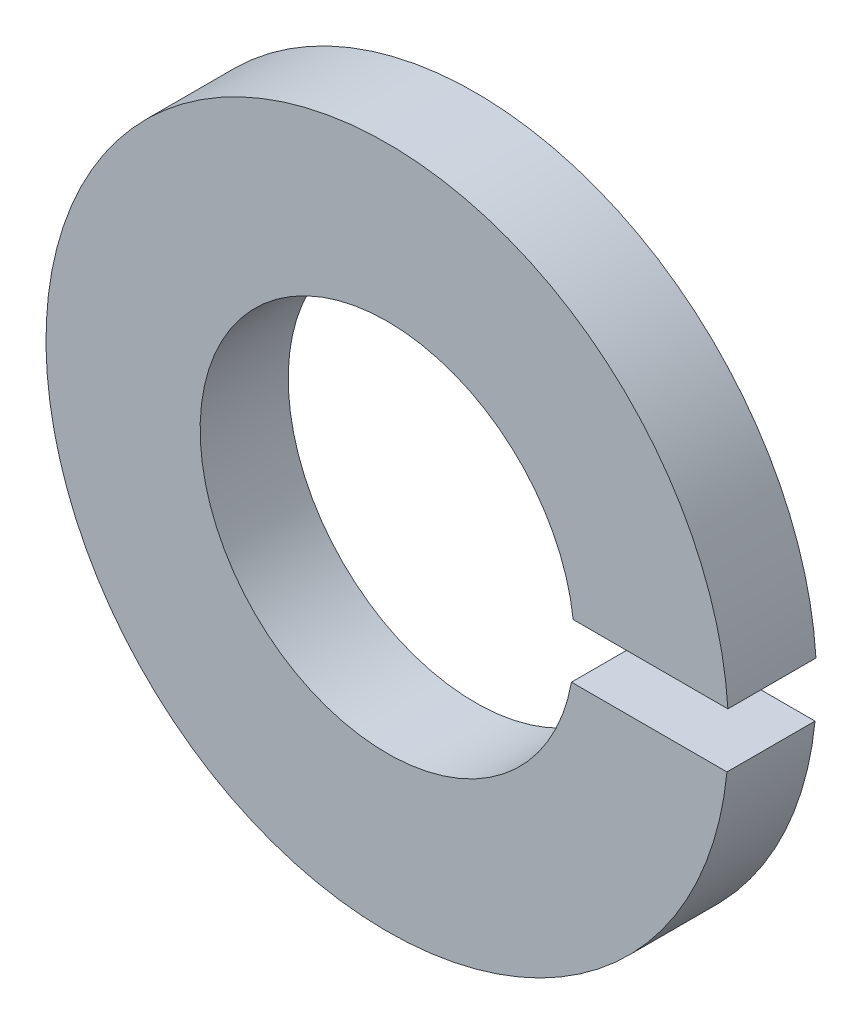
ISO-10303-21;
HEADER;
FILE_DESCRIPTION(('STEP AP214'),'2;1');
FILE_NAME('part.step','',(''),(''),'','','');
FILE_SCHEMA(('AUTOMOTIVE_DESIGN { 1 0 10303 214 1 1 1 1 }'));
ENDSEC;
DATA;
#1=APPLICATION_CONTEXT('core data for automotive mechanical design processes');
#2=APPLICATION_PROTOCOL_DEFINITION('international standard','automotive_design',2000,#1);
#3=PRODUCT_CONTEXT('',#1,'mechanical');
#4=PRODUCT('Part','Part','',(#3));
#5=PRODUCT_RELATED_PRODUCT_CATEGORY('part','',(#4));
#6=PRODUCT_DEFINITION_FORMATION('','',#4);
#7=PRODUCT_DEFINITION_CONTEXT('part definition',#1,'design');
#8=PRODUCT_DEFINITION('design','',#6,#7);
#9=PRODUCT_DEFINITION_SHAPE('','',#8);
#10=(LENGTH_UNIT() NAMED_UNIT(*) SI_UNIT(.MILLI.,.METRE.));
#11=(NAMED_UNIT(*) PLANE_ANGLE_UNIT() SI_UNIT($,.RADIAN.));
#12=(NAMED_UNIT(*) SI_UNIT($,.STERADIAN.) SOLID_ANGLE_UNIT());
#13=UNCERTAINTY_MEASURE_WITH_UNIT(LENGTH_MEASURE(1.E-05),#10,'distance_accuracy_value','');
#14=(GEOMETRIC_REPRESENTATION_CONTEXT(3) GLOBAL_UNCERTAINTY_ASSIGNED_CONTEXT((#13)) GLOBAL_UNIT_ASSIGNED_CONTEXT((#10,
#11,#12)) REPRESENTATION_CONTEXT('',''));
#15=CARTESIAN_POINT('',(0.,0.,0.));
#16=DIRECTION('',(0.,0.,1.));
#17=DIRECTION('',(1.,0.,0.));
#18=AXIS2_PLACEMENT_3D('',#15,#16,#17);
#19=CARTESIAN_POINT('',(0.,0.,0.8));
#20=DIRECTION('',(0.,0.,-1.));
#21=DIRECTION('',(-1.,0.,0.));
#22=AXIS2_PLACEMENT_3D('',#19,#20,#21);
#23=CYLINDRICAL_SURFACE('',#22,1.7);
#24=CARTESIAN_POINT('',(0.,0.,0.));
#25=DIRECTION('',(0.,0.,1.));
#26=DIRECTION('',(1.,0.,0.));
#27=AXIS2_PLACEMENT_3D('',#24,#25,#26);
#28=CIRCLE('',#27,1.7);
#29=CARTESIAN_POINT('',(1.68845590037502,0.197779353039688,0.));
#30=VERTEX_POINT('',#29);
#31=CARTESIAN_POINT('',(1.67292040472668,-0.302220646960312,0.));
#32=VERTEX_POINT('',#31);
#33=EDGE_CURVE('E98',#30,#32,#28,.T.);
#34=ORIENTED_EDGE('',*,*,#33,.F.);
#35=DIRECTION('',(0.,0.,-1.));
#36=VECTOR('',#35,1.);
#37=CARTESIAN_POINT('',(1.68845590037502,0.197779353039688,0.8));
#38=LINE('',#37,#36);
#39=CARTESIAN_POINT('',(1.68845590037502,0.197779353039688,0.8));
#40=VERTEX_POINT('',#39);
#41=EDGE_CURVE('E11',#40,#30,#38,.T.);
#42=ORIENTED_EDGE('',*,*,#41,.F.);
#43=CARTESIAN_POINT('',(0.,0.,0.8));
#44=DIRECTION('',(0.,0.,1.));
#45=DIRECTION('',(1.,0.,0.));
#46=AXIS2_PLACEMENT_3D('',#43,#44,#45);
#47=CIRCLE('',#46,1.7);
#48=CARTESIAN_POINT('',(1.67292040472668,-0.302220646960312,0.8));
#49=VERTEX_POINT('',#48);
#50=EDGE_CURVE('E92',#40,#49,#47,.T.);
#51=ORIENTED_EDGE('',*,*,#50,.T.);
#52=DIRECTION('',(0.,0.,-1.));
#53=VECTOR('',#52,1.);
#54=CARTESIAN_POINT('',(1.67292040472668,-0.302220646960312,0.8));
#55=LINE('',#54,#53);
#56=EDGE_CURVE('E73',#49,#32,#55,.T.);
#57=ORIENTED_EDGE('',*,*,#56,.T.);
#58=EDGE_LOOP('',(#34,#42,#51,#57));
#59=FACE_BOUND('',#58,.T.);
#60=ADVANCED_FACE('F35',(#59),#23,.F.);
#61=CARTESIAN_POINT('',(0.,0.197779353039688,0.8));
#62=DIRECTION('',(0.,-1.,0.));
#63=DIRECTION('',(0.,0.,-1.));
#64=AXIS2_PLACEMENT_3D('',#61,#62,#63);
#65=PLANE('',#64);
#66=DIRECTION('',(-1.,0.,0.));
#67=VECTOR('',#66,1.);
#68=CARTESIAN_POINT('',(0.,0.197779353039688,0.));
#69=LINE('',#68,#67);
#70=CARTESIAN_POINT('',(3.09368442597354,0.197779353039688,0.));
#71=VERTEX_POINT('',#70);
#72=EDGE_CURVE('E86',#71,#30,#69,.T.);
#73=ORIENTED_EDGE('',*,*,#72,.F.);
#74=DIRECTION('',(0.,0.,-1.));
#75=VECTOR('',#74,1.);
#76=CARTESIAN_POINT('',(3.09368442597354,0.197779353039688,0.8));
#77=LINE('',#76,#75);
#78=CARTESIAN_POINT('',(3.09368442597354,0.197779353039688,0.8));
#79=VERTEX_POINT('',#78);
#80=EDGE_CURVE('E43',#79,#71,#77,.T.);
#81=ORIENTED_EDGE('',*,*,#80,.F.);
#82=DIRECTION('',(-1.,0.,0.));
#83=VECTOR('',#82,1.);
#84=CARTESIAN_POINT('',(0.,0.197779353039688,0.8));
#85=LINE('',#84,#83);
#86=EDGE_CURVE('E84',#79,#40,#85,.T.);
#87=ORIENTED_EDGE('',*,*,#86,.T.);
#88=ORIENTED_EDGE('',*,*,#41,.T.);
#89=EDGE_LOOP('',(#73,#81,#87,#88));
#90=FACE_BOUND('',#89,.T.);
#91=ADVANCED_FACE('F82',(#90),#65,.T.);
#92=CARTESIAN_POINT('',(0.,0.,0.8));
#93=DIRECTION('',(0.,0.,-1.));
#94=DIRECTION('',(-1.,0.,0.));
#95=AXIS2_PLACEMENT_3D('',#92,#93,#94);
#96=CYLINDRICAL_SURFACE('',#95,3.1);
#97=CARTESIAN_POINT('',(0.,0.,0.));
#98=DIRECTION('',(0.,0.,1.));
#99=DIRECTION('',(1.,0.,0.));
#100=AXIS2_PLACEMENT_3D('',#97,#98,#99);
#101=CIRCLE('',#100,3.1);
#102=CARTESIAN_POINT('',(3.08523300263544,-0.302220646960312,0.));
#103=VERTEX_POINT('',#102);
#104=EDGE_CURVE('E66',#71,#103,#101,.T.);
#105=ORIENTED_EDGE('',*,*,#104,.T.);
#106=DIRECTION('',(0.,0.,-1.));
#107=VECTOR('',#106,1.);
#108=CARTESIAN_POINT('',(3.08523300263544,-0.302220646960312,0.8));
#109=LINE('',#108,#107);
#110=CARTESIAN_POINT('',(3.08523300263544,-0.302220646960312,0.8));
#111=VERTEX_POINT('',#110);
#112=EDGE_CURVE('E87',#111,#103,#109,.T.);
#113=ORIENTED_EDGE('',*,*,#112,.F.);
#114=CARTESIAN_POINT('',(0.,0.,0.8));
#115=DIRECTION('',(0.,0.,1.));
#116=DIRECTION('',(1.,0.,0.));
#117=AXIS2_PLACEMENT_3D('',#114,#115,#116);
#118=CIRCLE('',#117,3.1);
#119=EDGE_CURVE('E88',#79,#111,#118,.T.);
#120=ORIENTED_EDGE('',*,*,#119,.F.);
#121=ORIENTED_EDGE('',*,*,#80,.T.);
#122=EDGE_LOOP('',(#105,#113,#120,#121));
#123=FACE_BOUND('',#122,.T.);
#124=ADVANCED_FACE('F89',(#123),#96,.T.);
#125=CARTESIAN_POINT('',(0.,-0.302220646960312,0.8));
#126=DIRECTION('',(0.,-1.,0.));
#127=DIRECTION('',(0.,0.,-1.));
#128=AXIS2_PLACEMENT_3D('',#125,#126,#127);
#129=PLANE('',#128);
#130=DIRECTION('',(-1.,0.,0.));
#131=VECTOR('',#130,1.);
#132=CARTESIAN_POINT('',(0.,-0.302220646960312,0.));
#133=LINE('',#132,#131);
#134=EDGE_CURVE('E94',#103,#32,#133,.T.);
#135=ORIENTED_EDGE('',*,*,#134,.T.);
#136=ORIENTED_EDGE('',*,*,#56,.F.);
#137=DIRECTION('',(-1.,0.,0.));
#138=VECTOR('',#137,1.);
#139=CARTESIAN_POINT('',(0.,-0.302220646960312,0.8));
#140=LINE('',#139,#138);
#141=EDGE_CURVE('E51',#111,#49,#140,.T.);
#142=ORIENTED_EDGE('',*,*,#141,.F.);
#143=ORIENTED_EDGE('',*,*,#112,.T.);
#144=EDGE_LOOP('',(#135,#136,#142,#143));
#145=FACE_BOUND('',#144,.T.);
#146=ADVANCED_FACE('F107',(#145),#129,.F.);
#147=CARTESIAN_POINT('',(0.,0.,0.8));
#148=DIRECTION('',(0.,0.,1.));
#149=DIRECTION('',(1.,0.,0.));
#150=AXIS2_PLACEMENT_3D('',#147,#148,#149);
#151=PLANE('',#150);
#152=ORIENTED_EDGE('',*,*,#50,.F.);
#153=ORIENTED_EDGE('',*,*,#86,.F.);
#154=ORIENTED_EDGE('',*,*,#119,.T.);
#155=ORIENTED_EDGE('',*,*,#141,.T.);
#156=EDGE_LOOP('',(#152,#153,#154,#155));
#157=FACE_BOUND('',#156,.T.);
#158=ADVANCED_FACE('F91',(#157),#151,.T.);
#159=CARTESIAN_POINT('',(0.,0.,0.));
#160=DIRECTION('',(0.,0.,1.));
#161=DIRECTION('',(1.,0.,0.));
#162=AXIS2_PLACEMENT_3D('',#159,#160,#161);
#163=PLANE('',#162);
#164=ORIENTED_EDGE('',*,*,#33,.T.);
#165=ORIENTED_EDGE('',*,*,#134,.F.);
#166=ORIENTED_EDGE('',*,*,#104,.F.);
#167=ORIENTED_EDGE('',*,*,#72,.T.);
#168=EDGE_LOOP('',(#164,#165,#166,#167));
#169=FACE_BOUND('',#168,.T.);
#170=ADVANCED_FACE('F109',(#169),#163,.F.);
#171=CLOSED_SHELL('',(#60,#91,#124,#146,#158,#170));
#172=MANIFOLD_SOLID_BREP('B2',#171);
#173=ADVANCED_BREP_SHAPE_REPRESENTATION('',(#18,#172),#14);
#174=SHAPE_DEFINITION_REPRESENTATION(#9,#173);
ENDSEC;
END-ISO-10303-21;
